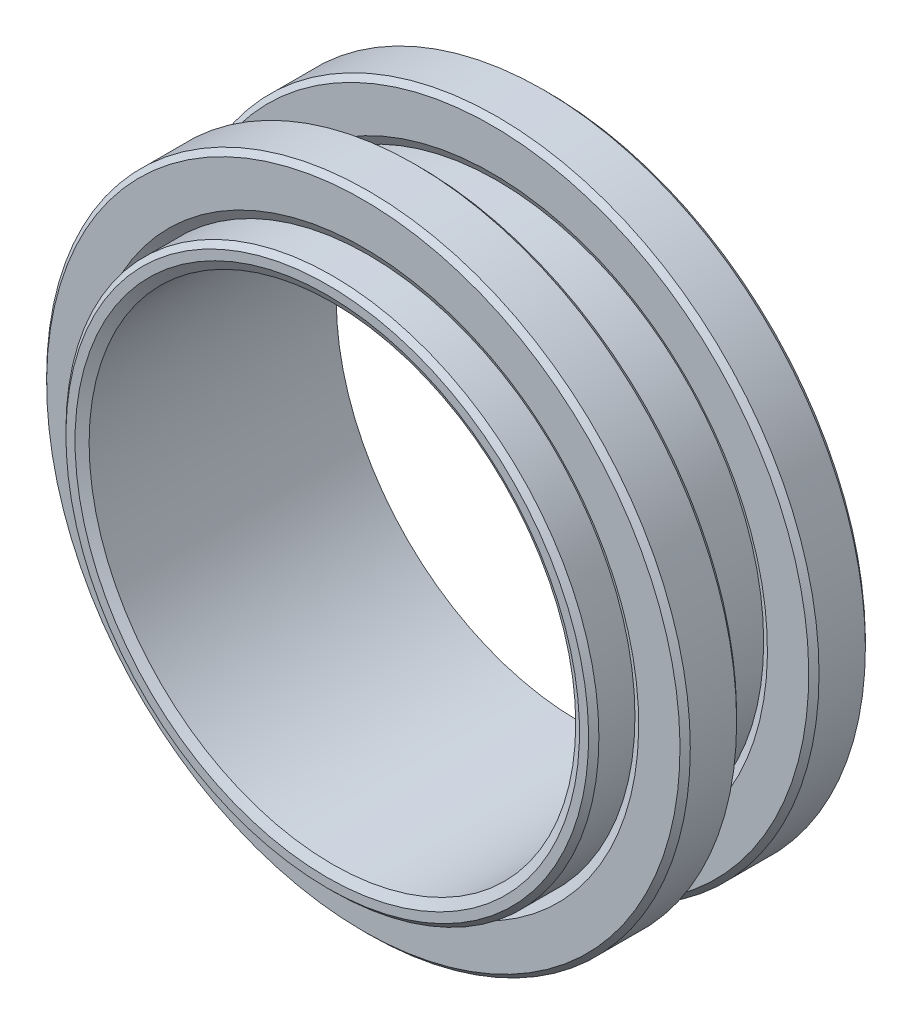
ISO-10303-21;
HEADER;
FILE_DESCRIPTION(('STEP AP214'),'2;1');
FILE_NAME('part.step','',(''),(''),'','','');
FILE_SCHEMA(('AUTOMOTIVE_DESIGN { 1 0 10303 214 1 1 1 1 }'));
ENDSEC;
DATA;
#1=APPLICATION_CONTEXT('core data for automotive mechanical design processes');
#2=APPLICATION_PROTOCOL_DEFINITION('international standard','automotive_design',2000,#1);
#3=PRODUCT_CONTEXT('',#1,'mechanical');
#4=PRODUCT('Part','Part','',(#3));
#5=PRODUCT_RELATED_PRODUCT_CATEGORY('part','',(#4));
#6=PRODUCT_DEFINITION_FORMATION('','',#4);
#7=PRODUCT_DEFINITION_CONTEXT('part definition',#1,'design');
#8=PRODUCT_DEFINITION('design','',#6,#7);
#9=PRODUCT_DEFINITION_SHAPE('','',#8);
#10=(LENGTH_UNIT() NAMED_UNIT(*) SI_UNIT(.MILLI.,.METRE.));
#11=(NAMED_UNIT(*) PLANE_ANGLE_UNIT() SI_UNIT($,.RADIAN.));
#12=(NAMED_UNIT(*) SI_UNIT($,.STERADIAN.) SOLID_ANGLE_UNIT());
#13=UNCERTAINTY_MEASURE_WITH_UNIT(LENGTH_MEASURE(1.E-05),#10,'distance_accuracy_value','');
#14=(GEOMETRIC_REPRESENTATION_CONTEXT(3) GLOBAL_UNCERTAINTY_ASSIGNED_CONTEXT((#13)) GLOBAL_UNIT_ASSIGNED_CONTEXT((#10,
#11,#12)) REPRESENTATION_CONTEXT('',''));
#15=CARTESIAN_POINT('',(0.,0.,0.));
#16=DIRECTION('',(0.,0.,1.));
#17=DIRECTION('',(1.,0.,0.));
#18=AXIS2_PLACEMENT_3D('',#15,#16,#17);
#19=CARTESIAN_POINT('',(0.,0.,-8.128));
#20=DIRECTION('',(0.,0.,1.));
#21=DIRECTION('',(0.,-1.,0.));
#22=AXIS2_PLACEMENT_3D('',#19,#20,#21);
#23=CONICAL_SURFACE('',#22,13.5844409051225,1.04719755119659);
#24=CARTESIAN_POINT('',(0.,0.,-8.382));
#25=DIRECTION('',(0.,0.,1.));
#26=DIRECTION('',(0.,-1.,0.));
#27=AXIS2_PLACEMENT_3D('',#24,#25,#26);
#28=CIRCLE('',#27,13.1445);
#29=CARTESIAN_POINT('',(0.,-13.1445,-8.382));
#30=VERTEX_POINT('',#29);
#31=EDGE_CURVE('P0_E9',#30,#30,#28,.T.);
#32=ORIENTED_EDGE('',*,*,#31,.F.);
#33=EDGE_LOOP('',(#32));
#34=FACE_BOUND('',#33,.T.);
#35=CARTESIAN_POINT('',(0.,0.,-8.128));
#36=DIRECTION('',(0.,0.,1.));
#37=DIRECTION('',(0.,-1.,0.));
#38=AXIS2_PLACEMENT_3D('',#35,#36,#37);
#39=CIRCLE('',#38,13.5844409051225);
#40=CARTESIAN_POINT('',(0.,-13.5844409051225,-8.128));
#41=VERTEX_POINT('',#40);
#42=EDGE_CURVE('P0_E42',#41,#41,#39,.T.);
#43=ORIENTED_EDGE('',*,*,#42,.T.);
#44=EDGE_LOOP('',(#43));
#45=FACE_BOUND('',#44,.T.);
#46=ADVANCED_FACE('P0_F14',(#34,#45),#23,.F.);
#47=CARTESIAN_POINT('',(0.,0.,-8.128));
#48=DIRECTION('',(0.,0.,1.));
#49=DIRECTION('',(0.,-1.,0.));
#50=AXIS2_PLACEMENT_3D('',#47,#48,#49);
#51=CYLINDRICAL_SURFACE('',#50,13.1445);
#52=CARTESIAN_POINT('',(0.,0.,-10.668));
#53=DIRECTION('',(0.,0.,1.));
#54=DIRECTION('',(0.,-1.,0.));
#55=AXIS2_PLACEMENT_3D('',#52,#53,#54);
#56=CIRCLE('',#55,13.1445);
#57=CARTESIAN_POINT('',(0.,-13.1445,-10.668));
#58=VERTEX_POINT('',#57);
#59=EDGE_CURVE('P0_E20',#58,#58,#56,.T.);
#60=ORIENTED_EDGE('',*,*,#59,.F.);
#61=EDGE_LOOP('',(#60));
#62=FACE_BOUND('',#61,.T.);
#63=ORIENTED_EDGE('',*,*,#31,.T.);
#64=EDGE_LOOP('',(#63));
#65=FACE_BOUND('',#64,.T.);
#66=ADVANCED_FACE('P0_F79',(#62,#65),#51,.F.);
#67=CARTESIAN_POINT('',(0.,0.,-10.668));
#68=DIRECTION('',(0.,0.,-1.));
#69=DIRECTION('',(0.,1.,0.));
#70=AXIS2_PLACEMENT_3D('',#67,#68,#69);
#71=CONICAL_SURFACE('',#70,13.1445,1.04719755119659);
#72=CARTESIAN_POINT('',(0.,0.,-10.922));
#73=DIRECTION('',(0.,0.,1.));
#74=DIRECTION('',(0.,-1.,0.));
#75=AXIS2_PLACEMENT_3D('',#72,#73,#74);
#76=CIRCLE('',#75,13.5844409051225);
#77=CARTESIAN_POINT('',(0.,-13.5844409051225,-10.922));
#78=VERTEX_POINT('',#77);
#79=EDGE_CURVE('P0_E24',#78,#78,#76,.T.);
#80=ORIENTED_EDGE('',*,*,#79,.F.);
#81=EDGE_LOOP('',(#80));
#82=FACE_BOUND('',#81,.T.);
#83=ORIENTED_EDGE('',*,*,#59,.T.);
#84=EDGE_LOOP('',(#83));
#85=FACE_BOUND('',#84,.T.);
#86=ADVANCED_FACE('P0_F74',(#82,#85),#71,.F.);
#87=CARTESIAN_POINT('',(13.5844409051225,0.,-10.922));
#88=DIRECTION('',(0.,0.,1.));
#89=DIRECTION('',(0.,-1.,0.));
#90=AXIS2_PLACEMENT_3D('',#87,#88,#89);
#91=PLANE('',#90);
#92=CARTESIAN_POINT('',(0.,0.,-10.922));
#93=DIRECTION('',(0.,0.,1.));
#94=DIRECTION('',(0.,-1.,0.));
#95=AXIS2_PLACEMENT_3D('',#92,#93,#94);
#96=CIRCLE('',#95,15.621);
#97=CARTESIAN_POINT('',(0.,-15.621,-10.922));
#98=VERTEX_POINT('',#97);
#99=EDGE_CURVE('P0_E28',#98,#98,#96,.T.);
#100=ORIENTED_EDGE('',*,*,#99,.F.);
#101=EDGE_LOOP('',(#100));
#102=FACE_BOUND('',#101,.T.);
#103=ORIENTED_EDGE('',*,*,#79,.T.);
#104=EDGE_LOOP('',(#103));
#105=FACE_BOUND('',#104,.T.);
#106=ADVANCED_FACE('P0_F68',(#102,#105),#91,.F.);
#107=CARTESIAN_POINT('',(0.,0.,-10.922));
#108=DIRECTION('',(0.,0.,1.));
#109=DIRECTION('',(0.,-1.,0.));
#110=AXIS2_PLACEMENT_3D('',#107,#108,#109);
#111=CONICAL_SURFACE('',#110,15.621,0.785398163397447);
#112=CARTESIAN_POINT('',(0.,0.,-10.668));
#113=DIRECTION('',(0.,0.,1.));
#114=DIRECTION('',(0.,-1.,0.));
#115=AXIS2_PLACEMENT_3D('',#112,#113,#114);
#116=CIRCLE('',#115,15.875);
#117=CARTESIAN_POINT('',(0.,-15.875,-10.668));
#118=VERTEX_POINT('',#117);
#119=EDGE_CURVE('P0_E33',#118,#118,#116,.T.);
#120=ORIENTED_EDGE('',*,*,#119,.F.);
#121=EDGE_LOOP('',(#120));
#122=FACE_BOUND('',#121,.T.);
#123=ORIENTED_EDGE('',*,*,#99,.T.);
#124=EDGE_LOOP('',(#123));
#125=FACE_BOUND('',#124,.T.);
#126=ADVANCED_FACE('P0_F62',(#122,#125),#111,.T.);
#127=CARTESIAN_POINT('',(0.,0.,-8.128));
#128=DIRECTION('',(0.,0.,1.));
#129=DIRECTION('',(0.,-1.,0.));
#130=AXIS2_PLACEMENT_3D('',#127,#128,#129);
#131=CYLINDRICAL_SURFACE('',#130,15.875);
#132=CARTESIAN_POINT('',(0.,0.,-8.382));
#133=DIRECTION('',(0.,0.,1.));
#134=DIRECTION('',(0.,-1.,0.));
#135=AXIS2_PLACEMENT_3D('',#132,#133,#134);
#136=CIRCLE('',#135,15.875);
#137=CARTESIAN_POINT('',(0.,-15.875,-8.382));
#138=VERTEX_POINT('',#137);
#139=EDGE_CURVE('P0_E36',#138,#138,#136,.T.);
#140=ORIENTED_EDGE('',*,*,#139,.F.);
#141=EDGE_LOOP('',(#140));
#142=FACE_BOUND('',#141,.T.);
#143=ORIENTED_EDGE('',*,*,#119,.T.);
#144=EDGE_LOOP('',(#143));
#145=FACE_BOUND('',#144,.T.);
#146=ADVANCED_FACE('P0_F56',(#142,#145),#131,.T.);
#147=CARTESIAN_POINT('',(0.,0.,-8.382));
#148=DIRECTION('',(0.,0.,-1.));
#149=DIRECTION('',(0.,1.,0.));
#150=AXIS2_PLACEMENT_3D('',#147,#148,#149);
#151=CONICAL_SURFACE('',#150,15.875,0.785398163397447);
#152=CARTESIAN_POINT('',(0.,0.,-8.128));
#153=DIRECTION('',(0.,0.,1.));
#154=DIRECTION('',(0.,-1.,0.));
#155=AXIS2_PLACEMENT_3D('',#152,#153,#154);
#156=CIRCLE('',#155,15.621);
#157=CARTESIAN_POINT('',(0.,-15.621,-8.128));
#158=VERTEX_POINT('',#157);
#159=EDGE_CURVE('P0_E39',#158,#158,#156,.T.);
#160=ORIENTED_EDGE('',*,*,#159,.F.);
#161=EDGE_LOOP('',(#160));
#162=FACE_BOUND('',#161,.T.);
#163=ORIENTED_EDGE('',*,*,#139,.T.);
#164=EDGE_LOOP('',(#163));
#165=FACE_BOUND('',#164,.T.);
#166=ADVANCED_FACE('P0_F50',(#162,#165),#151,.T.);
#167=CARTESIAN_POINT('',(13.5844409051225,0.,-8.128));
#168=DIRECTION('',(0.,0.,-1.));
#169=DIRECTION('',(0.,1.,0.));
#170=AXIS2_PLACEMENT_3D('',#167,#168,#169);
#171=PLANE('',#170);
#172=ORIENTED_EDGE('',*,*,#42,.F.);
#173=EDGE_LOOP('',(#172));
#174=FACE_BOUND('',#173,.T.);
#175=ORIENTED_EDGE('',*,*,#159,.T.);
#176=EDGE_LOOP('',(#175));
#177=FACE_BOUND('',#176,.T.);
#178=ADVANCED_FACE('P0_F47',(#174,#177),#171,.F.);
#179=CLOSED_SHELL('',(#46,#66,#86,#106,#126,#146,#166,#178));
#180=MANIFOLD_SOLID_BREP('P0_B1',#179);
#181=CARTESIAN_POINT('',(0.,0.,-1.778));
#182=DIRECTION('',(0.,0.,1.));
#183=DIRECTION('',(0.,-1.,0.));
#184=AXIS2_PLACEMENT_3D('',#181,#182,#183);
#185=CONICAL_SURFACE('',#184,13.5844409051225,1.04719755119659);
#186=CARTESIAN_POINT('',(0.,0.,-2.032));
#187=DIRECTION('',(0.,0.,1.));
#188=DIRECTION('',(0.,-1.,0.));
#189=AXIS2_PLACEMENT_3D('',#186,#187,#188);
#190=CIRCLE('',#189,13.1445);
#191=CARTESIAN_POINT('',(0.,-13.1445,-2.032));
#192=VERTEX_POINT('',#191);
#193=EDGE_CURVE('P1_E10',#192,#192,#190,.T.);
#194=ORIENTED_EDGE('',*,*,#193,.F.);
#195=EDGE_LOOP('',(#194));
#196=FACE_BOUND('',#195,.T.);
#197=CARTESIAN_POINT('',(0.,0.,-1.778));
#198=DIRECTION('',(0.,0.,1.));
#199=DIRECTION('',(0.,-1.,0.));
#200=AXIS2_PLACEMENT_3D('',#197,#198,#199);
#201=CIRCLE('',#200,13.5844409051225);
#202=CARTESIAN_POINT('',(0.,-13.5844409051225,-1.778));
#203=VERTEX_POINT('',#202);
#204=EDGE_CURVE('P1_E43',#203,#203,#201,.T.);
#205=ORIENTED_EDGE('',*,*,#204,.T.);
#206=EDGE_LOOP('',(#205));
#207=FACE_BOUND('',#206,.T.);
#208=ADVANCED_FACE('P1_F15',(#196,#207),#185,.F.);
#209=CARTESIAN_POINT('',(0.,0.,-1.778));
#210=DIRECTION('',(0.,0.,1.));
#211=DIRECTION('',(0.,-1.,0.));
#212=AXIS2_PLACEMENT_3D('',#209,#210,#211);
#213=CYLINDRICAL_SURFACE('',#212,13.1445);
#214=CARTESIAN_POINT('',(0.,0.,-4.318));
#215=DIRECTION('',(0.,0.,1.));
#216=DIRECTION('',(0.,-1.,0.));
#217=AXIS2_PLACEMENT_3D('',#214,#215,#216);
#218=CIRCLE('',#217,13.1445);
#219=CARTESIAN_POINT('',(0.,-13.1445,-4.318));
#220=VERTEX_POINT('',#219);
#221=EDGE_CURVE('P1_E21',#220,#220,#218,.T.);
#222=ORIENTED_EDGE('',*,*,#221,.F.);
#223=EDGE_LOOP('',(#222));
#224=FACE_BOUND('',#223,.T.);
#225=ORIENTED_EDGE('',*,*,#193,.T.);
#226=EDGE_LOOP('',(#225));
#227=FACE_BOUND('',#226,.T.);
#228=ADVANCED_FACE('P1_F80',(#224,#227),#213,.F.);
#229=CARTESIAN_POINT('',(0.,0.,-4.318));
#230=DIRECTION('',(0.,0.,-1.));
#231=DIRECTION('',(0.,1.,0.));
#232=AXIS2_PLACEMENT_3D('',#229,#230,#231);
#233=CONICAL_SURFACE('',#232,13.1445,1.04719755119659);
#234=CARTESIAN_POINT('',(0.,0.,-4.572));
#235=DIRECTION('',(0.,0.,1.));
#236=DIRECTION('',(0.,-1.,0.));
#237=AXIS2_PLACEMENT_3D('',#234,#235,#236);
#238=CIRCLE('',#237,13.5844409051225);
#239=CARTESIAN_POINT('',(0.,-13.5844409051225,-4.572));
#240=VERTEX_POINT('',#239);
#241=EDGE_CURVE('P1_E25',#240,#240,#238,.T.);
#242=ORIENTED_EDGE('',*,*,#241,.F.);
#243=EDGE_LOOP('',(#242));
#244=FACE_BOUND('',#243,.T.);
#245=ORIENTED_EDGE('',*,*,#221,.T.);
#246=EDGE_LOOP('',(#245));
#247=FACE_BOUND('',#246,.T.);
#248=ADVANCED_FACE('P1_F75',(#244,#247),#233,.F.);
#249=CARTESIAN_POINT('',(13.5844409051225,0.,-4.572));
#250=DIRECTION('',(0.,0.,1.));
#251=DIRECTION('',(0.,-1.,0.));
#252=AXIS2_PLACEMENT_3D('',#249,#250,#251);
#253=PLANE('',#252);
#254=CARTESIAN_POINT('',(0.,0.,-4.572));
#255=DIRECTION('',(0.,0.,1.));
#256=DIRECTION('',(0.,-1.,0.));
#257=AXIS2_PLACEMENT_3D('',#254,#255,#256);
#258=CIRCLE('',#257,15.621);
#259=CARTESIAN_POINT('',(0.,-15.621,-4.572));
#260=VERTEX_POINT('',#259);
#261=EDGE_CURVE('P1_E29',#260,#260,#258,.T.);
#262=ORIENTED_EDGE('',*,*,#261,.F.);
#263=EDGE_LOOP('',(#262));
#264=FACE_BOUND('',#263,.T.);
#265=ORIENTED_EDGE('',*,*,#241,.T.);
#266=EDGE_LOOP('',(#265));
#267=FACE_BOUND('',#266,.T.);
#268=ADVANCED_FACE('P1_F69',(#264,#267),#253,.F.);
#269=CARTESIAN_POINT('',(0.,0.,-4.572));
#270=DIRECTION('',(0.,0.,1.));
#271=DIRECTION('',(0.,-1.,0.));
#272=AXIS2_PLACEMENT_3D('',#269,#270,#271);
#273=CONICAL_SURFACE('',#272,15.621,0.785398163397447);
#274=CARTESIAN_POINT('',(0.,0.,-4.318));
#275=DIRECTION('',(0.,0.,1.));
#276=DIRECTION('',(0.,-1.,0.));
#277=AXIS2_PLACEMENT_3D('',#274,#275,#276);
#278=CIRCLE('',#277,15.875);
#279=CARTESIAN_POINT('',(0.,-15.875,-4.318));
#280=VERTEX_POINT('',#279);
#281=EDGE_CURVE('P1_E34',#280,#280,#278,.T.);
#282=ORIENTED_EDGE('',*,*,#281,.F.);
#283=EDGE_LOOP('',(#282));
#284=FACE_BOUND('',#283,.T.);
#285=ORIENTED_EDGE('',*,*,#261,.T.);
#286=EDGE_LOOP('',(#285));
#287=FACE_BOUND('',#286,.T.);
#288=ADVANCED_FACE('P1_F63',(#284,#287),#273,.T.);
#289=CARTESIAN_POINT('',(0.,0.,-1.778));
#290=DIRECTION('',(0.,0.,1.));
#291=DIRECTION('',(0.,-1.,0.));
#292=AXIS2_PLACEMENT_3D('',#289,#290,#291);
#293=CYLINDRICAL_SURFACE('',#292,15.875);
#294=CARTESIAN_POINT('',(0.,0.,-2.032));
#295=DIRECTION('',(0.,0.,1.));
#296=DIRECTION('',(0.,-1.,0.));
#297=AXIS2_PLACEMENT_3D('',#294,#295,#296);
#298=CIRCLE('',#297,15.875);
#299=CARTESIAN_POINT('',(0.,-15.875,-2.032));
#300=VERTEX_POINT('',#299);
#301=EDGE_CURVE('P1_E37',#300,#300,#298,.T.);
#302=ORIENTED_EDGE('',*,*,#301,.F.);
#303=EDGE_LOOP('',(#302));
#304=FACE_BOUND('',#303,.T.);
#305=ORIENTED_EDGE('',*,*,#281,.T.);
#306=EDGE_LOOP('',(#305));
#307=FACE_BOUND('',#306,.T.);
#308=ADVANCED_FACE('P1_F57',(#304,#307),#293,.T.);
#309=CARTESIAN_POINT('',(0.,0.,-2.032));
#310=DIRECTION('',(0.,0.,-1.));
#311=DIRECTION('',(0.,1.,0.));
#312=AXIS2_PLACEMENT_3D('',#309,#310,#311);
#313=CONICAL_SURFACE('',#312,15.875,0.785398163397447);
#314=CARTESIAN_POINT('',(0.,0.,-1.778));
#315=DIRECTION('',(0.,0.,1.));
#316=DIRECTION('',(0.,-1.,0.));
#317=AXIS2_PLACEMENT_3D('',#314,#315,#316);
#318=CIRCLE('',#317,15.621);
#319=CARTESIAN_POINT('',(0.,-15.621,-1.778));
#320=VERTEX_POINT('',#319);
#321=EDGE_CURVE('P1_E40',#320,#320,#318,.T.);
#322=ORIENTED_EDGE('',*,*,#321,.F.);
#323=EDGE_LOOP('',(#322));
#324=FACE_BOUND('',#323,.T.);
#325=ORIENTED_EDGE('',*,*,#301,.T.);
#326=EDGE_LOOP('',(#325));
#327=FACE_BOUND('',#326,.T.);
#328=ADVANCED_FACE('P1_F51',(#324,#327),#313,.T.);
#329=CARTESIAN_POINT('',(13.5844409051225,0.,-1.778));
#330=DIRECTION('',(0.,0.,-1.));
#331=DIRECTION('',(0.,1.,0.));
#332=AXIS2_PLACEMENT_3D('',#329,#330,#331);
#333=PLANE('',#332);
#334=ORIENTED_EDGE('',*,*,#204,.F.);
#335=EDGE_LOOP('',(#334));
#336=FACE_BOUND('',#335,.T.);
#337=ORIENTED_EDGE('',*,*,#321,.T.);
#338=EDGE_LOOP('',(#337));
#339=FACE_BOUND('',#338,.T.);
#340=ADVANCED_FACE('P1_F48',(#336,#339),#333,.F.);
#341=CLOSED_SHELL('',(#208,#228,#248,#268,#288,#308,#328,#340));
#342=MANIFOLD_SOLID_BREP('P1_B1',#341);
#343=CARTESIAN_POINT('',(0.,0.,0.));
#344=DIRECTION('',(0.,0.,1.));
#345=DIRECTION('',(0.,-1.,0.));
#346=AXIS2_PLACEMENT_3D('',#343,#344,#345);
#347=CONICAL_SURFACE('',#346,12.4414409051225,1.04719755119659);
#348=CARTESIAN_POINT('',(0.,0.,-0.254));
#349=DIRECTION('',(0.,0.,1.));
#350=DIRECTION('',(0.,-1.,0.));
#351=AXIS2_PLACEMENT_3D('',#348,#349,#350);
#352=CIRCLE('',#351,12.0015);
#353=CARTESIAN_POINT('',(0.,-12.0015,-0.254));
#354=VERTEX_POINT('',#353);
#355=EDGE_CURVE('P2_E10',#354,#354,#352,.T.);
#356=ORIENTED_EDGE('',*,*,#355,.F.);
#357=EDGE_LOOP('',(#356));
#358=FACE_BOUND('',#357,.T.);
#359=CARTESIAN_POINT('',(0.,0.,0.));
#360=DIRECTION('',(0.,0.,1.));
#361=DIRECTION('',(0.,-1.,0.));
#362=AXIS2_PLACEMENT_3D('',#359,#360,#361);
#363=CIRCLE('',#362,12.4414409051225);
#364=CARTESIAN_POINT('',(0.,-12.4414409051225,0.));
#365=VERTEX_POINT('',#364);
#366=EDGE_CURVE('P2_E43',#365,#365,#363,.T.);
#367=ORIENTED_EDGE('',*,*,#366,.T.);
#368=EDGE_LOOP('',(#367));
#369=FACE_BOUND('',#368,.T.);
#370=ADVANCED_FACE('P2_F15',(#358,#369),#347,.F.);
#371=CARTESIAN_POINT('',(0.,0.,0.));
#372=DIRECTION('',(0.,0.,1.));
#373=DIRECTION('',(0.,-1.,0.));
#374=AXIS2_PLACEMENT_3D('',#371,#372,#373);
#375=CYLINDRICAL_SURFACE('',#374,12.0015);
#376=CARTESIAN_POINT('',(0.,0.,-12.446));
#377=DIRECTION('',(0.,0.,1.));
#378=DIRECTION('',(0.,-1.,0.));
#379=AXIS2_PLACEMENT_3D('',#376,#377,#378);
#380=CIRCLE('',#379,12.0015);
#381=CARTESIAN_POINT('',(0.,-12.0015,-12.446));
#382=VERTEX_POINT('',#381);
#383=EDGE_CURVE('P2_E21',#382,#382,#380,.T.);
#384=ORIENTED_EDGE('',*,*,#383,.F.);
#385=EDGE_LOOP('',(#384));
#386=FACE_BOUND('',#385,.T.);
#387=ORIENTED_EDGE('',*,*,#355,.T.);
#388=EDGE_LOOP('',(#387));
#389=FACE_BOUND('',#388,.T.);
#390=ADVANCED_FACE('P2_F80',(#386,#389),#375,.F.);
#391=CARTESIAN_POINT('',(0.,0.,-12.446));
#392=DIRECTION('',(0.,0.,-1.));
#393=DIRECTION('',(0.,1.,0.));
#394=AXIS2_PLACEMENT_3D('',#391,#392,#393);
#395=CONICAL_SURFACE('',#394,12.0015,1.04719755119659);
#396=CARTESIAN_POINT('',(0.,0.,-12.7));
#397=DIRECTION('',(0.,0.,1.));
#398=DIRECTION('',(0.,-1.,0.));
#399=AXIS2_PLACEMENT_3D('',#396,#397,#398);
#400=CIRCLE('',#399,12.4414409051225);
#401=CARTESIAN_POINT('',(0.,-12.4414409051225,-12.7));
#402=VERTEX_POINT('',#401);
#403=EDGE_CURVE('P2_E25',#402,#402,#400,.T.);
#404=ORIENTED_EDGE('',*,*,#403,.F.);
#405=EDGE_LOOP('',(#404));
#406=FACE_BOUND('',#405,.T.);
#407=ORIENTED_EDGE('',*,*,#383,.T.);
#408=EDGE_LOOP('',(#407));
#409=FACE_BOUND('',#408,.T.);
#410=ADVANCED_FACE('P2_F75',(#406,#409),#395,.F.);
#411=CARTESIAN_POINT('',(12.4414409051225,0.,-12.7));
#412=DIRECTION('',(0.,0.,1.));
#413=DIRECTION('',(0.,-1.,0.));
#414=AXIS2_PLACEMENT_3D('',#411,#412,#413);
#415=PLANE('',#414);
#416=CARTESIAN_POINT('',(0.,0.,-12.7));
#417=DIRECTION('',(0.,0.,1.));
#418=DIRECTION('',(0.,-1.,0.));
#419=AXIS2_PLACEMENT_3D('',#416,#417,#418);
#420=CIRCLE('',#419,12.8905);
#421=CARTESIAN_POINT('',(0.,-12.8905,-12.7));
#422=VERTEX_POINT('',#421);
#423=EDGE_CURVE('P2_E29',#422,#422,#420,.T.);
#424=ORIENTED_EDGE('',*,*,#423,.F.);
#425=EDGE_LOOP('',(#424));
#426=FACE_BOUND('',#425,.T.);
#427=ORIENTED_EDGE('',*,*,#403,.T.);
#428=EDGE_LOOP('',(#427));
#429=FACE_BOUND('',#428,.T.);
#430=ADVANCED_FACE('P2_F69',(#426,#429),#415,.F.);
#431=CARTESIAN_POINT('',(0.,0.,-12.7));
#432=DIRECTION('',(0.,0.,1.));
#433=DIRECTION('',(0.,-1.,0.));
#434=AXIS2_PLACEMENT_3D('',#431,#432,#433);
#435=CONICAL_SURFACE('',#434,12.8905,0.785398163397448);
#436=CARTESIAN_POINT('',(0.,0.,-12.446));
#437=DIRECTION('',(0.,0.,1.));
#438=DIRECTION('',(0.,-1.,0.));
#439=AXIS2_PLACEMENT_3D('',#436,#437,#438);
#440=CIRCLE('',#439,13.1445);
#441=CARTESIAN_POINT('',(0.,-13.1445,-12.446));
#442=VERTEX_POINT('',#441);
#443=EDGE_CURVE('P2_E34',#442,#442,#440,.T.);
#444=ORIENTED_EDGE('',*,*,#443,.F.);
#445=EDGE_LOOP('',(#444));
#446=FACE_BOUND('',#445,.T.);
#447=ORIENTED_EDGE('',*,*,#423,.T.);
#448=EDGE_LOOP('',(#447));
#449=FACE_BOUND('',#448,.T.);
#450=ADVANCED_FACE('P2_F63',(#446,#449),#435,.T.);
#451=CARTESIAN_POINT('',(0.,0.,0.));
#452=DIRECTION('',(0.,0.,1.));
#453=DIRECTION('',(0.,-1.,0.));
#454=AXIS2_PLACEMENT_3D('',#451,#452,#453);
#455=CYLINDRICAL_SURFACE('',#454,13.1445);
#456=CARTESIAN_POINT('',(0.,0.,-0.254));
#457=DIRECTION('',(0.,0.,1.));
#458=DIRECTION('',(0.,-1.,0.));
#459=AXIS2_PLACEMENT_3D('',#456,#457,#458);
#460=CIRCLE('',#459,13.1445);
#461=CARTESIAN_POINT('',(0.,-13.1445,-0.254));
#462=VERTEX_POINT('',#461);
#463=EDGE_CURVE('P2_E37',#462,#462,#460,.T.);
#464=ORIENTED_EDGE('',*,*,#463,.F.);
#465=EDGE_LOOP('',(#464));
#466=FACE_BOUND('',#465,.T.);
#467=ORIENTED_EDGE('',*,*,#443,.T.);
#468=EDGE_LOOP('',(#467));
#469=FACE_BOUND('',#468,.T.);
#470=ADVANCED_FACE('P2_F57',(#466,#469),#455,.T.);
#471=CARTESIAN_POINT('',(0.,0.,-0.254));
#472=DIRECTION('',(0.,0.,-1.));
#473=DIRECTION('',(0.,1.,0.));
#474=AXIS2_PLACEMENT_3D('',#471,#472,#473);
#475=CONICAL_SURFACE('',#474,13.1445,0.78539816339745);
#476=CARTESIAN_POINT('',(0.,0.,0.));
#477=DIRECTION('',(0.,0.,1.));
#478=DIRECTION('',(0.,-1.,0.));
#479=AXIS2_PLACEMENT_3D('',#476,#477,#478);
#480=CIRCLE('',#479,12.8905);
#481=CARTESIAN_POINT('',(0.,-12.8905,0.));
#482=VERTEX_POINT('',#481);
#483=EDGE_CURVE('P2_E40',#482,#482,#480,.T.);
#484=ORIENTED_EDGE('',*,*,#483,.F.);
#485=EDGE_LOOP('',(#484));
#486=FACE_BOUND('',#485,.T.);
#487=ORIENTED_EDGE('',*,*,#463,.T.);
#488=EDGE_LOOP('',(#487));
#489=FACE_BOUND('',#488,.T.);
#490=ADVANCED_FACE('P2_F51',(#486,#489),#475,.T.);
#491=CARTESIAN_POINT('',(12.4414409051225,0.,0.));
#492=DIRECTION('',(0.,0.,-1.));
#493=DIRECTION('',(0.,1.,0.));
#494=AXIS2_PLACEMENT_3D('',#491,#492,#493);
#495=PLANE('',#494);
#496=ORIENTED_EDGE('',*,*,#366,.F.);
#497=EDGE_LOOP('',(#496));
#498=FACE_BOUND('',#497,.T.);
#499=ORIENTED_EDGE('',*,*,#483,.T.);
#500=EDGE_LOOP('',(#499));
#501=FACE_BOUND('',#500,.T.);
#502=ADVANCED_FACE('P2_F48',(#498,#501),#495,.F.);
#503=CLOSED_SHELL('',(#370,#390,#410,#430,#450,#470,#490,#502));
#504=MANIFOLD_SOLID_BREP('P2_B1',#503);
#505=ADVANCED_BREP_SHAPE_REPRESENTATION('',(#18,#180,#342,#504),#14);
#506=SHAPE_DEFINITION_REPRESENTATION(#9,#505);
ENDSEC;
END-ISO-10303-21;
